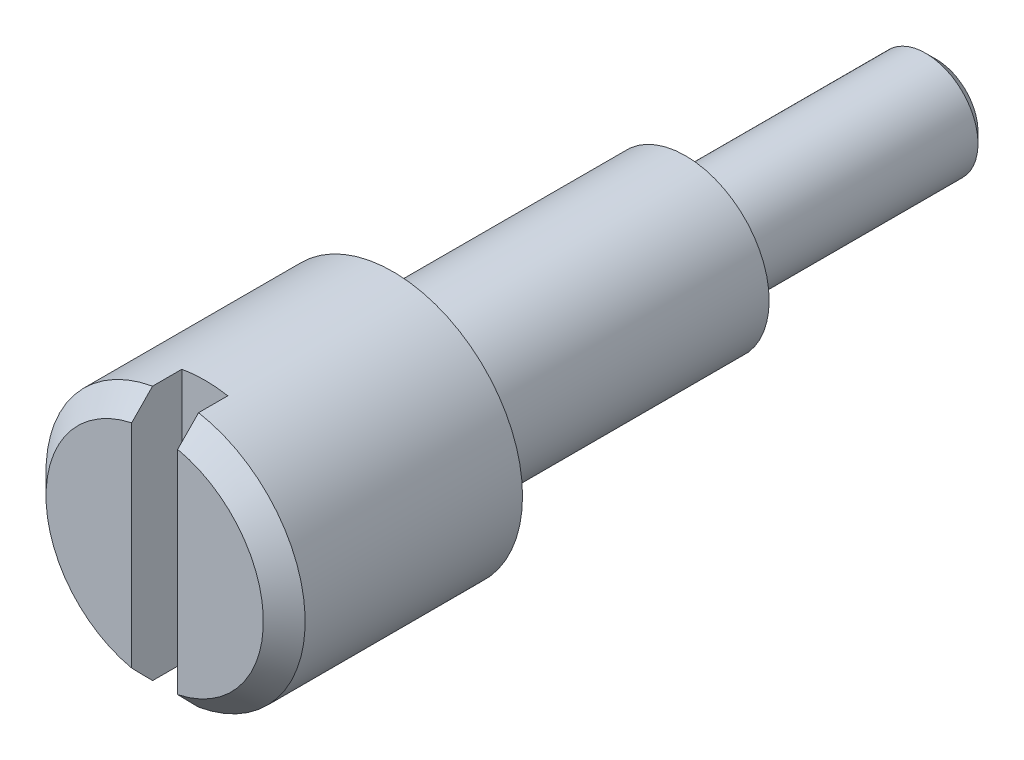
ISO-10303-21;
HEADER;
FILE_DESCRIPTION(('STEP AP214'),'2;1');
FILE_NAME('part.step','',(''),(''),'','','');
FILE_SCHEMA(('AUTOMOTIVE_DESIGN { 1 0 10303 214 1 1 1 1 }'));
ENDSEC;
DATA;
#1=APPLICATION_CONTEXT('core data for automotive mechanical design processes');
#2=APPLICATION_PROTOCOL_DEFINITION('international standard','automotive_design',2000,#1);
#3=PRODUCT_CONTEXT('',#1,'mechanical');
#4=PRODUCT('Part','Part','',(#3));
#5=PRODUCT_RELATED_PRODUCT_CATEGORY('part','',(#4));
#6=PRODUCT_DEFINITION_FORMATION('','',#4);
#7=PRODUCT_DEFINITION_CONTEXT('part definition',#1,'design');
#8=PRODUCT_DEFINITION('design','',#6,#7);
#9=PRODUCT_DEFINITION_SHAPE('','',#8);
#10=(LENGTH_UNIT() NAMED_UNIT(*) SI_UNIT(.MILLI.,.METRE.));
#11=(NAMED_UNIT(*) PLANE_ANGLE_UNIT() SI_UNIT($,.RADIAN.));
#12=(NAMED_UNIT(*) SI_UNIT($,.STERADIAN.) SOLID_ANGLE_UNIT());
#13=UNCERTAINTY_MEASURE_WITH_UNIT(LENGTH_MEASURE(1.E-05),#10,'distance_accuracy_value','');
#14=(GEOMETRIC_REPRESENTATION_CONTEXT(3) GLOBAL_UNCERTAINTY_ASSIGNED_CONTEXT((#13)) GLOBAL_UNIT_ASSIGNED_CONTEXT((#10,
#11,#12)) REPRESENTATION_CONTEXT('',''));
#15=CARTESIAN_POINT('',(0.,0.,0.));
#16=DIRECTION('',(0.,0.,1.));
#17=DIRECTION('',(1.,0.,0.));
#18=AXIS2_PLACEMENT_3D('',#15,#16,#17);
#19=CARTESIAN_POINT('',(0.,0.,5.7));
#20=DIRECTION('',(0.,0.,1.));
#21=DIRECTION('',(1.,0.,0.));
#22=AXIS2_PLACEMENT_3D('',#19,#20,#21);
#23=PLANE('',#22);
#24=DIRECTION('',(0.,1.,0.));
#25=VECTOR('',#24,1.);
#26=CARTESIAN_POINT('',(0.550000000000002,-3.50000000000003,5.7));
#27=LINE('',#26,#25);
#28=CARTESIAN_POINT('',(0.550000000000007,-2.54116115191464,5.7));
#29=VERTEX_POINT('',#28);
#30=CARTESIAN_POINT('',(0.55,2.54116115191461,5.7));
#31=VERTEX_POINT('',#30);
#32=EDGE_CURVE('E95',#29,#31,#27,.T.);
#33=ORIENTED_EDGE('',*,*,#32,.F.);
#34=CARTESIAN_POINT('',(0.,0.,5.7));
#35=DIRECTION('',(0.,0.,1.));
#36=DIRECTION('',(1.,0.,0.));
#37=AXIS2_PLACEMENT_3D('',#34,#35,#36);
#38=CIRCLE('',#37,2.6);
#39=EDGE_CURVE('E104',#29,#31,#38,.T.);
#40=ORIENTED_EDGE('',*,*,#39,.T.);
#41=EDGE_LOOP('',(#33,#40));
#42=FACE_BOUND('',#41,.T.);
#43=ADVANCED_FACE('F40',(#42),#23,.T.);
#44=CARTESIAN_POINT('',(0.,0.,5.7));
#45=DIRECTION('',(0.,0.,-1.));
#46=DIRECTION('',(-1.,0.,0.));
#47=AXIS2_PLACEMENT_3D('',#44,#45,#46);
#48=CONICAL_SURFACE('',#47,2.6,0.785398163397443);
#49=CARTESIAN_POINT('',(0.55,-6.81010362054149,1.46772283037984));
#50=CARTESIAN_POINT('',(0.55,-6.56766302612045,1.70936961033346));
#51=CARTESIAN_POINT('',(0.55,-6.32518719488952,1.95098107837735));
#52=CARTESIAN_POINT('',(0.55,-5.84010536127544,2.43409595939075));
#53=CARTESIAN_POINT('',(0.55,-5.59749935334187,2.67559936678689));
#54=CARTESIAN_POINT('',(0.55,-5.1118466404869,3.15871014823556));
#55=CARTESIAN_POINT('',(0.55,-4.8687997470204,3.4003173328032));
#56=CARTESIAN_POINT('',(0.55,-4.38245699087327,3.8832589311933));
#57=CARTESIAN_POINT('',(0.55,-4.13916114000119,4.12459335690563));
#58=CARTESIAN_POINT('',(0.55,-3.664928369846,4.5941749935574));
#59=CARTESIAN_POINT('',(0.55,-3.43401317351608,4.82244412136133));
#60=CARTESIAN_POINT('',(0.55,-3.08710833741925,5.16434000318843));
#61=CARTESIAN_POINT('',(0.55,-2.97137673542529,5.27822848254284));
#62=CARTESIAN_POINT('',(0.55,-2.7396699951505,5.50575443023481));
#63=CARTESIAN_POINT('',(0.55,-2.62369486012482,5.61939190188628));
#64=CARTESIAN_POINT('',(0.55,-2.39146873613014,5.84622732702415));
#65=CARTESIAN_POINT('',(0.55,-2.27521798758506,5.95942552632124));
#66=CARTESIAN_POINT('',(0.55,-2.04216431942725,6.1852641607545));
#67=CARTESIAN_POINT('',(0.55,-1.92536137190745,6.29790456709893));
#68=CARTESIAN_POINT('',(0.55,-1.69089734295998,6.52223735248232));
#69=CARTESIAN_POINT('',(0.55,-1.57323647339561,6.63392995176095));
#70=CARTESIAN_POINT('',(0.55,-1.39551968176088,6.80015035197129));
#71=CARTESIAN_POINT('',(0.55,-1.3360789961776,6.85533513887054));
#72=CARTESIAN_POINT('',(0.55,-1.21660638813783,6.9650600922109));
#73=CARTESIAN_POINT('',(0.55,-1.1565744835467,7.01960027802157));
#74=CARTESIAN_POINT('',(0.55,-1.06240379345599,7.10376578448992));
#75=CARTESIAN_POINT('',(0.55,-1.02856881730919,7.13373071349409));
#76=CARTESIAN_POINT('',(0.55,-0.960542659622403,7.1932614857942));
#77=CARTESIAN_POINT('',(0.550000000000001,-0.926351441843151,7.22282728777195));
#78=CARTESIAN_POINT('',(0.55,-0.857208139466633,7.28168118472351));
#79=CARTESIAN_POINT('',(0.549999999999998,-0.822252004946043,7.31096453591666));
#80=CARTESIAN_POINT('',(0.550000000000002,-0.751729266103576,7.36877062789948));
#81=CARTESIAN_POINT('',(0.550000000000007,-0.716162829703615,7.39729357256623));
#82=CARTESIAN_POINT('',(0.550000000000007,-0.643847393354213,7.45352726863661));
#83=CARTESIAN_POINT('',(0.550000000000002,-0.607090397374164,7.481227805644));
#84=CARTESIAN_POINT('',(0.549999999999998,-0.532327633152253,7.53501923360643));
#85=CARTESIAN_POINT('',(0.55,-0.494320299657971,7.56110797942065));
#86=CARTESIAN_POINT('',(0.550000000000001,-0.416948143322125,7.61046275001478));
#87=CARTESIAN_POINT('',(0.55,-0.37759783555469,7.6337511556469));
#88=CARTESIAN_POINT('',(0.55,-0.29669402628756,7.67602812398973));
#89=CARTESIAN_POINT('',(0.55,-0.255147663531889,7.69502967464132));
#90=CARTESIAN_POINT('',(0.55,-0.179588167598105,7.72221946218261));
#91=CARTESIAN_POINT('',(0.55,-0.146135878465993,7.73190500174313));
#92=CARTESIAN_POINT('',(0.55,-0.0781324813903886,7.74546584817643));
#93=CARTESIAN_POINT('',(0.55,-0.0435861131536758,7.74936343756235));
#94=CARTESIAN_POINT('',(0.550000000000001,0.0257950413628831,7.75049270268287));
#95=CARTESIAN_POINT('',(0.550000000000002,0.0606304083589828,7.74769122685317));
#96=CARTESIAN_POINT('',(0.549999999999998,0.129317980066061,7.73602910046959));
#97=CARTESIAN_POINT('',(0.549999999999993,0.163166569144994,7.72714852579228));
#98=CARTESIAN_POINT('',(0.549999999999993,0.2306889243151,7.70446798704345));
#99=CARTESIAN_POINT('',(0.549999999999998,0.264295323011501,7.69047663770965));
#100=CARTESIAN_POINT('',(0.550000000000002,0.329992576100255,7.65925215287139));
#101=CARTESIAN_POINT('',(0.550000000000001,0.36208047731464,7.64201300105963));
#102=CARTESIAN_POINT('',(0.55,0.425253479281856,7.60525098243724));
#103=CARTESIAN_POINT('',(0.55,0.45632806764046,7.58571037622955));
#104=CARTESIAN_POINT('',(0.55,0.517467168133189,7.54518201954393));
#105=CARTESIAN_POINT('',(0.549999999999998,0.547532547836688,7.52419556197578));
#106=CARTESIAN_POINT('',(0.549999999999998,0.609623318582682,7.47924370247191));
#107=CARTESIAN_POINT('',(0.55,0.641577824695637,7.45518107125367));
#108=CARTESIAN_POINT('',(0.550000000000001,0.704825160468631,7.40619849900135));
#109=CARTESIAN_POINT('',(0.55,0.736117901431375,7.3812784442068));
#110=CARTESIAN_POINT('',(0.55,0.829277808999632,7.30557713927021));
#111=CARTESIAN_POINT('',(0.55,0.890396334813653,7.2538774661729));
#112=CARTESIAN_POINT('',(0.55,1.01153099392094,7.1490045082624));
#113=CARTESIAN_POINT('',(0.55,1.07154496773267,7.09582876073387));
#114=CARTESIAN_POINT('',(0.55,1.19076300555793,6.98861218312276));
#115=CARTESIAN_POINT('',(0.55,1.2499672945027,6.93457160273257));
#116=CARTESIAN_POINT('',(0.55,1.36762677650714,6.82609771960422));
#117=CARTESIAN_POINT('',(0.55,1.42608387721176,6.7716664790864));
#118=CARTESIAN_POINT('',(0.55,1.54261818807189,6.66239101471586));
#119=CARTESIAN_POINT('',(0.55,1.60069537081729,6.60754676166622));
#120=CARTESIAN_POINT('',(0.55,1.77438244279272,6.44269140919767));
#121=CARTESIAN_POINT('',(0.549999999999999,1.88957417515454,6.33224023571161));
#122=CARTESIAN_POINT('',(0.549999999999998,2.20736546243183,6.02578475254656));
#123=CARTESIAN_POINT('',(0.549999999999999,2.40929490766759,5.8290875624333));
#124=CARTESIAN_POINT('',(0.550000000000001,2.81224725602726,5.43476189934849));
#125=CARTESIAN_POINT('',(0.55,3.01327014117131,5.23713340806398));
#126=CARTESIAN_POINT('',(0.55,3.41490296061743,4.84125563875942));
#127=CARTESIAN_POINT('',(0.55,3.615512636438,4.6430060985495));
#128=CARTESIAN_POINT('',(0.55,4.01642071708883,4.24619584207656));
#129=CARTESIAN_POINT('',(0.55,4.21671912428381,4.0476351282008));
#130=CARTESIAN_POINT('',(0.55,4.61666987762931,3.65074921786534));
#131=CARTESIAN_POINT('',(0.55,4.81632267231137,3.45242447334278));
#132=CARTESIAN_POINT('',(0.55,5.21549000015145,3.0556349057765));
#133=CARTESIAN_POINT('',(0.55,5.41500453295552,2.85717008237677));
#134=CARTESIAN_POINT('',(0.55,5.81382511805084,2.46024974582647));
#135=CARTESIAN_POINT('',(0.549999999999999,6.01313122467021,2.26179428725841));
#136=CARTESIAN_POINT('',(0.550000000000001,6.41166791686925,1.86480867314103));
#137=CARTESIAN_POINT('',(0.550000000000003,6.61089850265998,1.66627851780361));
#138=CARTESIAN_POINT('',(0.550000000000007,6.81010362054149,1.46772283037984));
#139=B_SPLINE_CURVE_WITH_KNOTS('',3,(#49,#50,#51,#52,#53,#54,#55,#56,#57,#58,#59,#60,#61,#62,
#63,#64,#65,#66,#67,#68,#69,#70,#71,#72,#73,#74,#75,#76,#77,#78,#79,#80,#81,#82,#83,#84,#85,#86,
#87,#88,#89,#90,#91,#92,#93,#94,#95,#96,#97,#98,#99,#100,#101,#102,#103,#104,#105,#106,#107,
#108,#109,#110,#111,#112,#113,#114,#115,#116,#117,#118,#119,#120,#121,#122,#123,#124,#125,#126,
#127,#128,#129,#130,#131,#132,#133,#134,#135,#136,#137,#138),.UNSPECIFIED.,.F.,.F.,(4,2,2,2,2,2,
2,2,2,2,2,2,2,2,2,2,2,2,2,2,2,2,2,2,2,2,2,2,2,2,2,2,2,2,2,2,2,2,2,2,2,2,2,2,4),(0.,
1.02690581406896,2.05385958686992,3.08197053796337,4.1100347961596,5.08412703166816,
5.57124020085417,6.05834690006909,6.54512324757332,7.03192446456275,7.51860928418791,
7.76193149399103,8.00524637354673,8.14083287714169,8.27643331083845,8.41322879174897,
8.54998721903924,8.68803720367462,8.82626712832751,8.96330623882113,9.09992441130858,
9.2040229898988,9.30771976021524,9.41193075431266,9.51648494350356,9.62544133996551,
9.73460159056839,9.8446663504788,9.95463393466167,10.0746171602955,10.1946163668085,
10.4347283552396,10.6752683932283,10.9157401930753,11.155362346154,11.3950016008044,
11.8737626224391,12.7194429596121,13.5651399960796,14.4112622897591,15.2573781236192,
16.1016205668706,16.9458651634785,17.7896467705172,18.6334260017189),.UNSPECIFIED.);
#140=CARTESIAN_POINT('',(0.550000000000007,-3.05081956201939,5.2));
#141=VERTEX_POINT('',#140);
#142=EDGE_CURVE('E92',#141,#29,#139,.T.);
#143=ORIENTED_EDGE('',*,*,#142,.F.);
#144=CARTESIAN_POINT('',(0.,0.,5.2));
#145=DIRECTION('',(0.,0.,1.));
#146=DIRECTION('',(1.,0.,0.));
#147=AXIS2_PLACEMENT_3D('',#144,#145,#146);
#148=CIRCLE('',#147,3.1);
#149=CARTESIAN_POINT('',(0.55,3.05081956201936,5.2));
#150=VERTEX_POINT('',#149);
#151=EDGE_CURVE('E111',#150,#141,#148,.F.);
#152=ORIENTED_EDGE('',*,*,#151,.F.);
#153=EDGE_CURVE('E101',#31,#150,#139,.T.);
#154=ORIENTED_EDGE('',*,*,#153,.F.);
#155=ORIENTED_EDGE('',*,*,#39,.F.);
#156=EDGE_LOOP('',(#143,#152,#154,#155));
#157=FACE_BOUND('',#156,.T.);
#158=ADVANCED_FACE('F106',(#157),#48,.T.);
#159=CARTESIAN_POINT('',(0.,0.,-7.00000000000001));
#160=DIRECTION('',(0.,0.,-1.));
#161=DIRECTION('',(-1.,0.,0.));
#162=AXIS2_PLACEMENT_3D('',#159,#160,#161);
#163=PLANE('',#162);
#164=CARTESIAN_POINT('',(0.,0.,-7.00000000000001));
#165=DIRECTION('',(0.,0.,-1.));
#166=DIRECTION('',(-1.,0.,0.));
#167=AXIS2_PLACEMENT_3D('',#164,#165,#166);
#168=CIRCLE('',#167,2.);
#169=CARTESIAN_POINT('',(-2.,0.,-7.00000000000001));
#170=VERTEX_POINT('',#169);
#171=EDGE_CURVE('E270',#170,#170,#168,.T.);
#172=ORIENTED_EDGE('',*,*,#171,.T.);
#173=EDGE_LOOP('',(#172));
#174=FACE_BOUND('',#173,.T.);
#175=CARTESIAN_POINT('',(0.,0.,-7.00000000000001));
#176=DIRECTION('',(0.,0.,-1.));
#177=DIRECTION('',(-1.,0.,0.));
#178=AXIS2_PLACEMENT_3D('',#175,#176,#177);
#179=CIRCLE('',#178,1.25);
#180=CARTESIAN_POINT('',(-1.25,0.,-7.00000000000001));
#181=VERTEX_POINT('',#180);
#182=EDGE_CURVE('E266',#181,#181,#179,.T.);
#183=ORIENTED_EDGE('',*,*,#182,.F.);
#184=EDGE_LOOP('',(#183));
#185=FACE_BOUND('',#184,.T.);
#186=ADVANCED_FACE('F149',(#174,#185),#163,.T.);
#187=CARTESIAN_POINT('',(0.,0.,0.));
#188=DIRECTION('',(0.,0.,1.));
#189=DIRECTION('',(1.,0.,0.));
#190=AXIS2_PLACEMENT_3D('',#187,#188,#189);
#191=PLANE('',#190);
#192=CARTESIAN_POINT('',(0.,0.,0.));
#193=DIRECTION('',(0.,0.,1.));
#194=DIRECTION('',(1.,0.,0.));
#195=AXIS2_PLACEMENT_3D('',#192,#193,#194);
#196=CIRCLE('',#195,3.1);
#197=CARTESIAN_POINT('',(3.1,0.,0.));
#198=VERTEX_POINT('',#197);
#199=EDGE_CURVE('E278',#198,#198,#196,.T.);
#200=ORIENTED_EDGE('',*,*,#199,.F.);
#201=EDGE_LOOP('',(#200));
#202=FACE_BOUND('',#201,.T.);
#203=CARTESIAN_POINT('',(0.,0.,0.));
#204=DIRECTION('',(0.,0.,1.));
#205=DIRECTION('',(1.,0.,0.));
#206=AXIS2_PLACEMENT_3D('',#203,#204,#205);
#207=CIRCLE('',#206,2.);
#208=CARTESIAN_POINT('',(2.,0.,0.));
#209=VERTEX_POINT('',#208);
#210=EDGE_CURVE('E281',#209,#209,#207,.F.);
#211=ORIENTED_EDGE('',*,*,#210,.F.);
#212=EDGE_LOOP('',(#211));
#213=FACE_BOUND('',#212,.T.);
#214=ADVANCED_FACE('F152',(#202,#213),#191,.F.);
#215=CARTESIAN_POINT('',(0.,0.,5.7));
#216=DIRECTION('',(0.,0.,-1.));
#217=DIRECTION('',(-1.,0.,0.));
#218=AXIS2_PLACEMENT_3D('',#215,#216,#217);
#219=CYLINDRICAL_SURFACE('',#218,3.1);
#220=CARTESIAN_POINT('',(0.,0.,4.5));
#221=DIRECTION('',(0.,0.,-1.));
#222=DIRECTION('',(-1.,0.,0.));
#223=AXIS2_PLACEMENT_3D('',#220,#221,#222);
#224=CIRCLE('',#223,3.1);
#225=CARTESIAN_POINT('',(-0.55,3.05081956201936,4.49999999999999));
#226=VERTEX_POINT('',#225);
#227=CARTESIAN_POINT('',(0.55,3.05081956201936,4.5));
#228=VERTEX_POINT('',#227);
#229=EDGE_CURVE('E11',#226,#228,#224,.T.);
#230=ORIENTED_EDGE('',*,*,#229,.T.);
#231=DIRECTION('',(0.,0.,-1.));
#232=VECTOR('',#231,1.);
#233=CARTESIAN_POINT('',(0.55,3.05081956201936,5.7));
#234=LINE('',#233,#232);
#235=EDGE_CURVE('E267',#228,#150,#234,.F.);
#236=ORIENTED_EDGE('',*,*,#235,.T.);
#237=ORIENTED_EDGE('',*,*,#151,.T.);
#238=DIRECTION('',(0.,0.,-1.));
#239=VECTOR('',#238,1.);
#240=CARTESIAN_POINT('',(0.550000000000007,-3.05081956201939,5.7));
#241=LINE('',#240,#239);
#242=CARTESIAN_POINT('',(0.55,-3.05081956201939,4.5));
#243=VERTEX_POINT('',#242);
#244=EDGE_CURVE('E64',#141,#243,#241,.T.);
#245=ORIENTED_EDGE('',*,*,#244,.T.);
#246=CARTESIAN_POINT('',(-0.549999999999999,-3.05081956201935,4.49999999999999));
#247=VERTEX_POINT('',#246);
#248=EDGE_CURVE('E45',#243,#247,#224,.T.);
#249=ORIENTED_EDGE('',*,*,#248,.T.);
#250=DIRECTION('',(0.,0.,-1.));
#251=VECTOR('',#250,1.);
#252=CARTESIAN_POINT('',(-0.55,-3.05081956201935,5.69999999999999));
#253=LINE('',#252,#251);
#254=CARTESIAN_POINT('',(-0.55,-3.05081956201935,5.19999999999998));
#255=VERTEX_POINT('',#254);
#256=EDGE_CURVE('E258',#247,#255,#253,.F.);
#257=ORIENTED_EDGE('',*,*,#256,.T.);
#258=CARTESIAN_POINT('',(-0.55,3.05081956201936,5.19999999999998));
#259=VERTEX_POINT('',#258);
#260=EDGE_CURVE('E118',#255,#259,#148,.F.);
#261=ORIENTED_EDGE('',*,*,#260,.T.);
#262=DIRECTION('',(0.,0.,-1.));
#263=VECTOR('',#262,1.);
#264=CARTESIAN_POINT('',(-0.55,3.05081956201936,5.69999999999999));
#265=LINE('',#264,#263);
#266=EDGE_CURVE('E272',#259,#226,#265,.T.);
#267=ORIENTED_EDGE('',*,*,#266,.T.);
#268=EDGE_LOOP('',(#230,#236,#237,#245,#249,#257,#261,#267));
#269=FACE_BOUND('',#268,.T.);
#270=ORIENTED_EDGE('',*,*,#199,.T.);
#271=EDGE_LOOP('',(#270));
#272=FACE_BOUND('',#271,.T.);
#273=ADVANCED_FACE('F160',(#269,#272),#219,.T.);
#274=DIRECTION('',(0.,-1.,0.));
#275=VECTOR('',#274,1.);
#276=CARTESIAN_POINT('',(-0.55,-3.5,5.69999999999999));
#277=LINE('',#276,#275);
#278=CARTESIAN_POINT('',(-0.55,2.54116115191462,5.69999999999999));
#279=VERTEX_POINT('',#278);
#280=CARTESIAN_POINT('',(-0.55,-2.54116115191461,5.69999999999999));
#281=VERTEX_POINT('',#280);
#282=EDGE_CURVE('E56',#279,#281,#277,.T.);
#283=ORIENTED_EDGE('',*,*,#282,.F.);
#284=EDGE_CURVE('E107',#279,#281,#38,.T.);
#285=ORIENTED_EDGE('',*,*,#284,.T.);
#286=EDGE_LOOP('',(#283,#285));
#287=FACE_BOUND('',#286,.T.);
#288=ADVANCED_FACE('F156',(#287),#23,.T.);
#289=CARTESIAN_POINT('',(0.,0.,-7.00000000000001));
#290=DIRECTION('',(0.,0.,1.));
#291=DIRECTION('',(1.,0.,0.));
#292=AXIS2_PLACEMENT_3D('',#289,#290,#291);
#293=CYLINDRICAL_SURFACE('',#292,2.);
#294=ORIENTED_EDGE('',*,*,#171,.F.);
#295=EDGE_LOOP('',(#294));
#296=FACE_BOUND('',#295,.T.);
#297=ORIENTED_EDGE('',*,*,#210,.T.);
#298=EDGE_LOOP('',(#297));
#299=FACE_BOUND('',#298,.T.);
#300=ADVANCED_FACE('F147',(#296,#299),#293,.T.);
#301=CARTESIAN_POINT('',(0.,0.,-13.));
#302=DIRECTION('',(0.,0.,1.));
#303=DIRECTION('',(1.,0.,0.));
#304=AXIS2_PLACEMENT_3D('',#301,#302,#303);
#305=CYLINDRICAL_SURFACE('',#304,1.25);
#306=CARTESIAN_POINT('',(0.,0.,-12.7465));
#307=DIRECTION('',(0.,0.,-1.));
#308=DIRECTION('',(-1.,0.,0.));
#309=AXIS2_PLACEMENT_3D('',#306,#307,#308);
#310=CIRCLE('',#309,1.25);
#311=CARTESIAN_POINT('',(-1.25,0.,-12.7465));
#312=VERTEX_POINT('',#311);
#313=EDGE_CURVE('E108',#312,#312,#310,.F.);
#314=ORIENTED_EDGE('',*,*,#313,.T.);
#315=EDGE_LOOP('',(#314));
#316=FACE_BOUND('',#315,.T.);
#317=ORIENTED_EDGE('',*,*,#182,.T.);
#318=EDGE_LOOP('',(#317));
#319=FACE_BOUND('',#318,.T.);
#320=ADVANCED_FACE('F143',(#316,#319),#305,.T.);
#321=CARTESIAN_POINT('',(0.,0.,-13.));
#322=DIRECTION('',(0.,0.,-1.));
#323=DIRECTION('',(-1.,0.,0.));
#324=AXIS2_PLACEMENT_3D('',#321,#322,#323);
#325=PLANE('',#324);
#326=CARTESIAN_POINT('',(0.,0.,-13.));
#327=DIRECTION('',(0.,0.,-1.));
#328=DIRECTION('',(-1.,0.,0.));
#329=AXIS2_PLACEMENT_3D('',#326,#327,#328);
#330=CIRCLE('',#329,0.996500000000004);
#331=CARTESIAN_POINT('',(-0.996500000000004,0.,-13.));
#332=VERTEX_POINT('',#331);
#333=EDGE_CURVE('E113',#332,#332,#330,.T.);
#334=ORIENTED_EDGE('',*,*,#333,.T.);
#335=EDGE_LOOP('',(#334));
#336=FACE_BOUND('',#335,.T.);
#337=ADVANCED_FACE('F139',(#336),#325,.T.);
#338=CARTESIAN_POINT('',(0.,0.,-13.));
#339=DIRECTION('',(0.,0.,1.));
#340=DIRECTION('',(1.,0.,0.));
#341=AXIS2_PLACEMENT_3D('',#338,#339,#340);
#342=CONICAL_SURFACE('',#341,0.996500000000004,0.785398163397446);
#343=ORIENTED_EDGE('',*,*,#313,.F.);
#344=EDGE_LOOP('',(#343));
#345=FACE_BOUND('',#344,.T.);
#346=ORIENTED_EDGE('',*,*,#333,.F.);
#347=EDGE_LOOP('',(#346));
#348=FACE_BOUND('',#347,.T.);
#349=ADVANCED_FACE('F142',(#345,#348),#342,.T.);
#350=CARTESIAN_POINT('',(-0.549999999999999,6.81010362054149,1.46772283037982));
#351=CARTESIAN_POINT('',(-0.549999999999999,6.56766302612045,1.70936961033345));
#352=CARTESIAN_POINT('',(-0.549999999999999,6.32518719488953,1.95098107837734));
#353=CARTESIAN_POINT('',(-0.549999999999999,5.84010536127545,2.43409595939075));
#354=CARTESIAN_POINT('',(-0.549999999999999,5.59749935334188,2.67559936678688));
#355=CARTESIAN_POINT('',(-0.549999999999999,5.11184664048691,3.15871014823556));
#356=CARTESIAN_POINT('',(-0.549999999999999,4.86879974702041,3.40031733280319));
#357=CARTESIAN_POINT('',(-0.549999999999999,4.38245699087328,3.88325893119329));
#358=CARTESIAN_POINT('',(-0.549999999999999,4.13916114000121,4.12459335690562));
#359=CARTESIAN_POINT('',(-0.549999999999999,3.66492836984602,4.59417499355738));
#360=CARTESIAN_POINT('',(-0.549999999999999,3.43401317351609,4.82244412136132));
#361=CARTESIAN_POINT('',(-0.549999999999999,3.08710833741927,5.16434000318842));
#362=CARTESIAN_POINT('',(-0.549999999999999,2.9713767354253,5.27822848254283));
#363=CARTESIAN_POINT('',(-0.549999999999999,2.73966999515051,5.5057544302348));
#364=CARTESIAN_POINT('',(-0.549999999999999,2.62369486012483,5.61939190188627));
#365=CARTESIAN_POINT('',(-0.549999999999999,2.39146873613015,5.84622732702413));
#366=CARTESIAN_POINT('',(-0.549999999999999,2.27521798758507,5.95942552632123));
#367=CARTESIAN_POINT('',(-0.549999999999999,2.04216431942726,6.18526416075449));
#368=CARTESIAN_POINT('',(-0.55,1.92536137190746,6.29790456709893));
#369=CARTESIAN_POINT('',(-0.549999999999999,1.69089734295999,6.52223735248231));
#370=CARTESIAN_POINT('',(-0.549999999999999,1.57323647339561,6.63392995176095));
#371=CARTESIAN_POINT('',(-0.55,1.39551968176089,6.80015035197129));
#372=CARTESIAN_POINT('',(-0.550000000000001,1.33607899617761,6.85533513887054));
#373=CARTESIAN_POINT('',(-0.549999999999998,1.21660638813783,6.96506009221089));
#374=CARTESIAN_POINT('',(-0.549999999999996,1.15657448354668,7.01960027802155));
#375=CARTESIAN_POINT('',(-0.549999999999997,1.06240379345597,7.10376578448991));
#376=CARTESIAN_POINT('',(-0.549999999999999,1.02856881730919,7.13373071349409));
#377=CARTESIAN_POINT('',(-0.55,0.960542659622402,7.19326148579421));
#378=CARTESIAN_POINT('',(-0.55,0.926351441843148,7.22282728777196));
#379=CARTESIAN_POINT('',(-0.549999999999999,0.857208139466632,7.28168118472352));
#380=CARTESIAN_POINT('',(-0.549999999999999,0.822252004946045,7.31096453591666));
#381=CARTESIAN_POINT('',(-0.55,0.751729266103572,7.36877062789948));
#382=CARTESIAN_POINT('',(-0.55,0.716162829703602,7.39729357256622));
#383=CARTESIAN_POINT('',(-0.55,0.643847393354199,7.4535272686366));
#384=CARTESIAN_POINT('',(-0.55,0.607090397374159,7.481227805644));
#385=CARTESIAN_POINT('',(-0.549999999999999,0.532327633152254,7.53501923360643));
#386=CARTESIAN_POINT('',(-0.549999999999999,0.49432029965797,7.56110797942065));
#387=CARTESIAN_POINT('',(-0.549999999999999,0.416948143322124,7.61046275001478));
#388=CARTESIAN_POINT('',(-0.549999999999999,0.37759783555469,7.63375115564691));
#389=CARTESIAN_POINT('',(-0.55,0.296694026287555,7.67602812398972));
#390=CARTESIAN_POINT('',(-0.55,0.255147663531876,7.69502967464131));
#391=CARTESIAN_POINT('',(-0.55,0.179588167598093,7.7222194621826));
#392=CARTESIAN_POINT('',(-0.55,0.146135878465986,7.73190500174314));
#393=CARTESIAN_POINT('',(-0.549999999999999,0.0781324813903878,7.74546584817643));
#394=CARTESIAN_POINT('',(-0.549999999999999,0.0435861131536752,7.74936343756234));
#395=CARTESIAN_POINT('',(-0.549999999999999,-0.025795041362884,7.75049270268286));
#396=CARTESIAN_POINT('',(-0.549999999999999,-0.0606304083589844,7.74769122685317));
#397=CARTESIAN_POINT('',(-0.55,-0.129317980066061,7.73602910046959));
#398=CARTESIAN_POINT('',(-0.55,-0.163166569144993,7.72714852579226));
#399=CARTESIAN_POINT('',(-0.55,-0.230688924315101,7.70446798704343));
#400=CARTESIAN_POINT('',(-0.55,-0.264295323011507,7.69047663770964));
#401=CARTESIAN_POINT('',(-0.549999999999999,-0.329992576100265,7.65925215287139));
#402=CARTESIAN_POINT('',(-0.549999999999999,-0.362080477314648,7.64201300105963));
#403=CARTESIAN_POINT('',(-0.55,-0.425253479281864,7.60525098243723));
#404=CARTESIAN_POINT('',(-0.55,-0.456328067640469,7.58571037622955));
#405=CARTESIAN_POINT('',(-0.549999999999999,-0.517467168133194,7.54518201954392));
#406=CARTESIAN_POINT('',(-0.549999999999997,-0.547532547836688,7.52419556197577));
#407=CARTESIAN_POINT('',(-0.549999999999996,-0.609623318582682,7.4792437024719));
#408=CARTESIAN_POINT('',(-0.549999999999999,-0.641577824695642,7.45518107125367));
#409=CARTESIAN_POINT('',(-0.55,-0.704825160468641,7.40619849900134));
#410=CARTESIAN_POINT('',(-0.55,-0.736117901431384,7.3812784442068));
#411=CARTESIAN_POINT('',(-0.549999999999999,-0.829277808999639,7.30557713927021));
#412=CARTESIAN_POINT('',(-0.549999999999999,-0.890396334813661,7.25387746617289));
#413=CARTESIAN_POINT('',(-0.55,-1.01153099392095,7.14900450826239));
#414=CARTESIAN_POINT('',(-0.549999999999999,-1.07154496773268,7.09582876073387));
#415=CARTESIAN_POINT('',(-0.549999999999999,-1.19076300555793,6.98861218312276));
#416=CARTESIAN_POINT('',(-0.549999999999999,-1.2499672945027,6.93457160273257));
#417=CARTESIAN_POINT('',(-0.549999999999999,-1.36762677650715,6.82609771960422));
#418=CARTESIAN_POINT('',(-0.549999999999999,-1.42608387721176,6.7716664790864));
#419=CARTESIAN_POINT('',(-0.549999999999999,-1.5426181880719,6.66239101471586));
#420=CARTESIAN_POINT('',(-0.549999999999999,-1.60069537081729,6.60754676166621));
#421=CARTESIAN_POINT('',(-0.549999999999999,-1.77438244279272,6.44269140919767));
#422=CARTESIAN_POINT('',(-0.549999999999999,-1.88957417515453,6.3322402357116));
#423=CARTESIAN_POINT('',(-0.549999999999999,-2.20736546243182,6.02578475254654));
#424=CARTESIAN_POINT('',(-0.549999999999999,-2.40929490766759,5.82908756243329));
#425=CARTESIAN_POINT('',(-0.55,-2.81224725602726,5.43476189934848));
#426=CARTESIAN_POINT('',(-0.549999999999999,-3.01327014117132,5.23713340806397));
#427=CARTESIAN_POINT('',(-0.549999999999999,-3.41490296061743,4.84125563875942));
#428=CARTESIAN_POINT('',(-0.549999999999999,-3.61551263643801,4.6430060985495));
#429=CARTESIAN_POINT('',(-0.549999999999999,-4.01642071708883,4.24619584207655));
#430=CARTESIAN_POINT('',(-0.549999999999999,-4.21671912428382,4.0476351282008));
#431=CARTESIAN_POINT('',(-0.549999999999999,-4.61666987762932,3.65074921786533));
#432=CARTESIAN_POINT('',(-0.549999999999999,-4.81632267231138,3.45242447334277));
#433=CARTESIAN_POINT('',(-0.549999999999999,-5.21549000015146,3.05563490577649));
#434=CARTESIAN_POINT('',(-0.549999999999999,-5.41500453295553,2.85717008237676));
#435=CARTESIAN_POINT('',(-0.549999999999999,-5.81382511805085,2.46024974582646));
#436=CARTESIAN_POINT('',(-0.549999999999999,-6.01313122467022,2.2617942872584));
#437=CARTESIAN_POINT('',(-0.549999999999999,-6.41166791686926,1.86480867314102));
#438=CARTESIAN_POINT('',(-0.549999999999999,-6.61089850265999,1.6662785178036));
#439=CARTESIAN_POINT('',(-0.549999999999999,-6.81010362054149,1.46772283037982));
#440=B_SPLINE_CURVE_WITH_KNOTS('',3,(#350,#351,#352,#353,#354,#355,#356,#357,#358,#359,#360,
#361,#362,#363,#364,#365,#366,#367,#368,#369,#370,#371,#372,#373,#374,#375,#376,#377,#378,#379,
#380,#381,#382,#383,#384,#385,#386,#387,#388,#389,#390,#391,#392,#393,#394,#395,#396,#397,#398,
#399,#400,#401,#402,#403,#404,#405,#406,#407,#408,#409,#410,#411,#412,#413,#414,#415,#416,#417,
#418,#419,#420,#421,#422,#423,#424,#425,#426,#427,#428,#429,#430,#431,#432,#433,#434,#435,#436,
#437,#438,#439),.UNSPECIFIED.,.F.,.F.,(4,2,2,2,2,2,2,2,2,2,2,2,2,2,2,2,2,2,2,2,2,2,2,2,2,2,2,2,
2,2,2,2,2,2,2,2,2,2,2,2,2,2,2,2,4),(0.,1.02690581406896,2.05385958686992,3.08197053796336,
4.11003479615958,5.08412703166816,5.57124020085416,6.05834690006908,6.54512324757332,
7.03192446456276,7.51860928418792,7.76193149399104,8.00524637354675,8.14083287714171,
8.27643331083847,8.41322879174898,8.54998721903926,8.68803720367463,8.82626712832752,
8.96330623882114,9.0999244113086,9.20402298989881,9.30771976021525,9.41193075431267,
9.51648494350358,9.62544133996552,9.7346015905684,9.84466635047882,9.95463393466168,
10.0746171602955,10.1946163668085,10.4347283552396,10.6752683932283,10.9157401930753,
11.155362346154,11.3950016008044,11.8737626224391,12.7194429596121,13.5651399960796,
14.4112622897591,15.2573781236192,16.1016205668706,16.9458651634785,17.7896467705172,
18.6334260017189),.UNSPECIFIED.);
#441=EDGE_CURVE('E125',#259,#279,#440,.T.);
#442=ORIENTED_EDGE('',*,*,#441,.F.);
#443=ORIENTED_EDGE('',*,*,#260,.F.);
#444=EDGE_CURVE('E119',#281,#255,#440,.T.);
#445=ORIENTED_EDGE('',*,*,#444,.F.);
#446=ORIENTED_EDGE('',*,*,#284,.F.);
#447=EDGE_LOOP('',(#442,#443,#445,#446));
#448=FACE_BOUND('',#447,.T.);
#449=ADVANCED_FACE('F42',(#448),#48,.T.);
#450=CARTESIAN_POINT('',(0.,0.,4.5));
#451=DIRECTION('',(0.,0.,-1.));
#452=DIRECTION('',(-1.,0.,0.));
#453=AXIS2_PLACEMENT_3D('',#450,#451,#452);
#454=PLANE('',#453);
#455=DIRECTION('',(0.,-1.,0.));
#456=VECTOR('',#455,1.);
#457=CARTESIAN_POINT('',(-0.549999999999999,-3.5,4.49999999999999));
#458=LINE('',#457,#456);
#459=EDGE_CURVE('E254',#226,#247,#458,.T.);
#460=ORIENTED_EDGE('',*,*,#459,.T.);
#461=ORIENTED_EDGE('',*,*,#248,.F.);
#462=DIRECTION('',(0.,1.,0.));
#463=VECTOR('',#462,1.);
#464=CARTESIAN_POINT('',(0.55,-3.50000000000003,4.5));
#465=LINE('',#464,#463);
#466=EDGE_CURVE('E259',#243,#228,#465,.T.);
#467=ORIENTED_EDGE('',*,*,#466,.T.);
#468=ORIENTED_EDGE('',*,*,#229,.F.);
#469=EDGE_LOOP('',(#460,#461,#467,#468));
#470=FACE_BOUND('',#469,.T.);
#471=ADVANCED_FACE('F135',(#470),#454,.F.);
#472=CARTESIAN_POINT('',(0.55,-3.50000000000003,4.5));
#473=DIRECTION('',(1.,0.,0.));
#474=DIRECTION('',(0.,0.,-1.));
#475=AXIS2_PLACEMENT_3D('',#472,#473,#474);
#476=PLANE('',#475);
#477=ORIENTED_EDGE('',*,*,#142,.T.);
#478=ORIENTED_EDGE('',*,*,#32,.T.);
#479=ORIENTED_EDGE('',*,*,#153,.T.);
#480=ORIENTED_EDGE('',*,*,#235,.F.);
#481=ORIENTED_EDGE('',*,*,#466,.F.);
#482=ORIENTED_EDGE('',*,*,#244,.F.);
#483=EDGE_LOOP('',(#477,#478,#479,#480,#481,#482));
#484=FACE_BOUND('',#483,.T.);
#485=ADVANCED_FACE('F94',(#484),#476,.F.);
#486=CARTESIAN_POINT('',(-0.549999999999999,-3.5,4.49999999999999));
#487=DIRECTION('',(-1.,0.,0.));
#488=DIRECTION('',(0.,0.,1.));
#489=AXIS2_PLACEMENT_3D('',#486,#487,#488);
#490=PLANE('',#489);
#491=ORIENTED_EDGE('',*,*,#441,.T.);
#492=ORIENTED_EDGE('',*,*,#282,.T.);
#493=ORIENTED_EDGE('',*,*,#444,.T.);
#494=ORIENTED_EDGE('',*,*,#256,.F.);
#495=ORIENTED_EDGE('',*,*,#459,.F.);
#496=ORIENTED_EDGE('',*,*,#266,.F.);
#497=EDGE_LOOP('',(#491,#492,#493,#494,#495,#496));
#498=FACE_BOUND('',#497,.T.);
#499=ADVANCED_FACE('F131',(#498),#490,.F.);
#500=CLOSED_SHELL('',(#43,#158,#186,#214,#273,#288,#300,#320,#337,#349,#449,#471,#485,#499));
#501=MANIFOLD_SOLID_BREP('B2',#500);
#502=ADVANCED_BREP_SHAPE_REPRESENTATION('',(#18,#501),#14);
#503=SHAPE_DEFINITION_REPRESENTATION(#9,#502);
ENDSEC;
END-ISO-10303-21;
